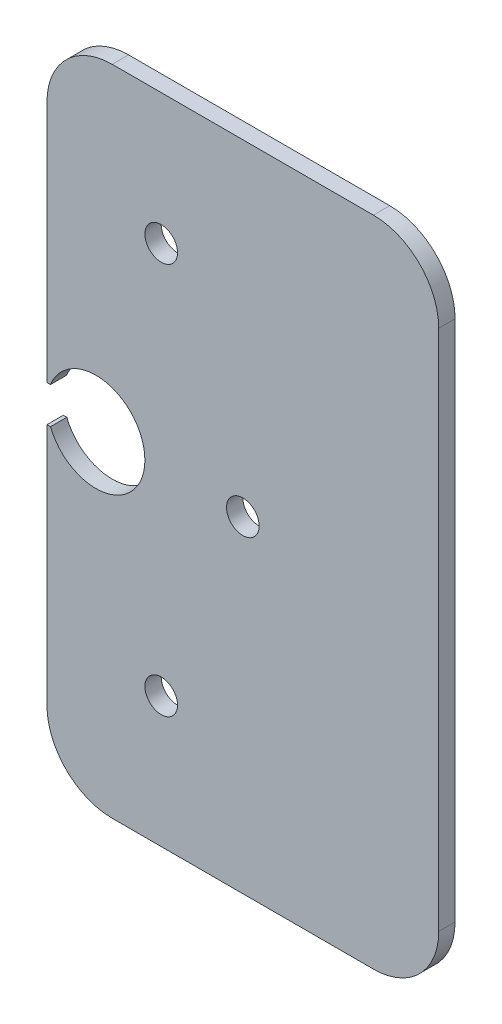
ISO-10303-21;
HEADER;
FILE_DESCRIPTION(('STEP AP214'),'2;1');
FILE_NAME('part.step','',(''),(''),'','','');
FILE_SCHEMA(('AUTOMOTIVE_DESIGN { 1 0 10303 214 1 1 1 1 }'));
ENDSEC;
DATA;
#1=APPLICATION_CONTEXT('core data for automotive mechanical design processes');
#2=APPLICATION_PROTOCOL_DEFINITION('international standard','automotive_design',2000,#1);
#3=PRODUCT_CONTEXT('',#1,'mechanical');
#4=PRODUCT('Part','Part','',(#3));
#5=PRODUCT_RELATED_PRODUCT_CATEGORY('part','',(#4));
#6=PRODUCT_DEFINITION_FORMATION('','',#4);
#7=PRODUCT_DEFINITION_CONTEXT('part definition',#1,'design');
#8=PRODUCT_DEFINITION('design','',#6,#7);
#9=PRODUCT_DEFINITION_SHAPE('','',#8);
#10=(LENGTH_UNIT() NAMED_UNIT(*) SI_UNIT(.MILLI.,.METRE.));
#11=(NAMED_UNIT(*) PLANE_ANGLE_UNIT() SI_UNIT($,.RADIAN.));
#12=(NAMED_UNIT(*) SI_UNIT($,.STERADIAN.) SOLID_ANGLE_UNIT());
#13=UNCERTAINTY_MEASURE_WITH_UNIT(LENGTH_MEASURE(1.E-05),#10,'distance_accuracy_value','');
#14=(GEOMETRIC_REPRESENTATION_CONTEXT(3) GLOBAL_UNCERTAINTY_ASSIGNED_CONTEXT((#13)) GLOBAL_UNIT_ASSIGNED_CONTEXT((#10,
#11,#12)) REPRESENTATION_CONTEXT('',''));
#15=CARTESIAN_POINT('',(0.,0.,0.));
#16=DIRECTION('',(0.,0.,1.));
#17=DIRECTION('',(1.,0.,0.));
#18=AXIS2_PLACEMENT_3D('',#15,#16,#17);
#19=CARTESIAN_POINT('',(-450.215,1024.45552803745,3.175));
#20=DIRECTION('',(0.,0.,1.));
#21=DIRECTION('',(0.,1.,0.));
#22=AXIS2_PLACEMENT_3D('',#19,#20,#21);
#23=ELLIPSE('',#22,9.54794789392333,9.52500000000006);
#24=DIRECTION('',(0.,0.,-1.));
#25=VECTOR('',#24,1.);
#26=SURFACE_OF_LINEAR_EXTRUSION('',#23,#25);
#27=CARTESIAN_POINT('',(-450.215,1024.45552803745,0.));
#28=DIRECTION('',(0.,0.,1.));
#29=DIRECTION('',(0.,1.,0.));
#30=AXIS2_PLACEMENT_3D('',#27,#28,#29);
#31=ELLIPSE('',#30,9.54794789392333,9.52500000000006);
#32=CARTESIAN_POINT('',(-459.058883104327,1020.90986665038,0.));
#33=VERTEX_POINT('',#32);
#34=CARTESIAN_POINT('',(-459.058883104327,1028.00118942453,0.));
#35=VERTEX_POINT('',#34);
#36=EDGE_CURVE('E164',#33,#35,#31,.T.);
#37=ORIENTED_EDGE('',*,*,#36,.F.);
#38=DIRECTION('',(0.,0.,-1.));
#39=VECTOR('',#38,1.);
#40=CARTESIAN_POINT('',(-459.058883104327,1020.90986665038,3.175));
#41=LINE('',#40,#39);
#42=CARTESIAN_POINT('',(-459.058883104327,1020.90986665038,3.175));
#43=VERTEX_POINT('',#42);
#44=EDGE_CURVE('E11',#43,#33,#41,.T.);
#45=ORIENTED_EDGE('',*,*,#44,.F.);
#46=CARTESIAN_POINT('',(-459.058883104327,1028.00118942453,3.175));
#47=VERTEX_POINT('',#46);
#48=EDGE_CURVE('E203',#43,#47,#23,.T.);
#49=ORIENTED_EDGE('',*,*,#48,.T.);
#50=DIRECTION('',(0.,0.,-1.));
#51=VECTOR('',#50,1.);
#52=CARTESIAN_POINT('',(-459.058883104327,1028.00118942453,3.175));
#53=LINE('',#52,#51);
#54=EDGE_CURVE('E99',#47,#35,#53,.T.);
#55=ORIENTED_EDGE('',*,*,#54,.T.);
#56=EDGE_LOOP('',(#37,#45,#49,#55));
#57=FACE_BOUND('',#56,.T.);
#58=ADVANCED_FACE('F36',(#57),#26,.T.);
#59=CARTESIAN_POINT('',(0.,1020.90986665038,3.175));
#60=DIRECTION('',(0.,1.,0.));
#61=DIRECTION('',(0.,0.,1.));
#62=AXIS2_PLACEMENT_3D('',#59,#60,#61);
#63=PLANE('',#62);
#64=DIRECTION('',(1.,0.,0.));
#65=VECTOR('',#64,1.);
#66=CARTESIAN_POINT('',(0.,1020.90986665038,0.));
#67=LINE('',#66,#65);
#68=CARTESIAN_POINT('',(-459.74,1020.90986665038,0.));
#69=VERTEX_POINT('',#68);
#70=EDGE_CURVE('E167',#69,#33,#67,.T.);
#71=ORIENTED_EDGE('',*,*,#70,.F.);
#72=DIRECTION('',(0.,0.,-1.));
#73=VECTOR('',#72,1.);
#74=CARTESIAN_POINT('',(-459.74,1020.90986665038,3.175));
#75=LINE('',#74,#73);
#76=CARTESIAN_POINT('',(-459.74,1020.90986665038,3.175));
#77=VERTEX_POINT('',#76);
#78=EDGE_CURVE('E45',#77,#69,#75,.T.);
#79=ORIENTED_EDGE('',*,*,#78,.F.);
#80=DIRECTION('',(1.,0.,0.));
#81=VECTOR('',#80,1.);
#82=CARTESIAN_POINT('',(0.,1020.90986665038,3.175));
#83=LINE('',#82,#81);
#84=EDGE_CURVE('E243',#77,#43,#83,.T.);
#85=ORIENTED_EDGE('',*,*,#84,.T.);
#86=ORIENTED_EDGE('',*,*,#44,.T.);
#87=EDGE_LOOP('',(#71,#79,#85,#86));
#88=FACE_BOUND('',#87,.T.);
#89=ADVANCED_FACE('F230',(#88),#63,.T.);
#90=CARTESIAN_POINT('',(-459.74,0.,3.175));
#91=DIRECTION('',(-1.,0.,0.));
#92=DIRECTION('',(0.,0.,1.));
#93=AXIS2_PLACEMENT_3D('',#90,#91,#92);
#94=PLANE('',#93);
#95=DIRECTION('',(0.,1.,0.));
#96=VECTOR('',#95,1.);
#97=CARTESIAN_POINT('',(-459.74,0.,0.));
#98=LINE('',#97,#96);
#99=CARTESIAN_POINT('',(-459.74,973.655528037452,0.));
#100=VERTEX_POINT('',#99);
#101=EDGE_CURVE('E170',#100,#69,#98,.T.);
#102=ORIENTED_EDGE('',*,*,#101,.F.);
#103=DIRECTION('',(0.,0.,-1.));
#104=VECTOR('',#103,1.);
#105=CARTESIAN_POINT('',(-459.74,973.655528037452,3.175));
#106=LINE('',#105,#104);
#107=CARTESIAN_POINT('',(-459.74,973.655528037452,3.175));
#108=VERTEX_POINT('',#107);
#109=EDGE_CURVE('E219',#108,#100,#106,.T.);
#110=ORIENTED_EDGE('',*,*,#109,.F.);
#111=DIRECTION('',(0.,1.,0.));
#112=VECTOR('',#111,1.);
#113=CARTESIAN_POINT('',(-459.74,0.,3.175));
#114=LINE('',#113,#112);
#115=EDGE_CURVE('E226',#108,#77,#114,.T.);
#116=ORIENTED_EDGE('',*,*,#115,.T.);
#117=ORIENTED_EDGE('',*,*,#78,.T.);
#118=EDGE_LOOP('',(#102,#110,#116,#117));
#119=FACE_BOUND('',#118,.T.);
#120=ADVANCED_FACE('F224',(#119),#94,.T.);
#121=CARTESIAN_POINT('',(-447.04,973.655528037452,3.175));
#122=DIRECTION('',(0.,0.,-1.));
#123=DIRECTION('',(-1.,0.,0.));
#124=AXIS2_PLACEMENT_3D('',#121,#122,#123);
#125=CYLINDRICAL_SURFACE('',#124,12.7);
#126=CARTESIAN_POINT('',(-447.04,973.655528037452,0.));
#127=DIRECTION('',(0.,0.,1.));
#128=DIRECTION('',(1.,0.,0.));
#129=AXIS2_PLACEMENT_3D('',#126,#127,#128);
#130=CIRCLE('',#129,12.7);
#131=CARTESIAN_POINT('',(-447.04,960.955528037452,0.));
#132=VERTEX_POINT('',#131);
#133=EDGE_CURVE('E173',#132,#100,#130,.F.);
#134=ORIENTED_EDGE('',*,*,#133,.F.);
#135=DIRECTION('',(0.,0.,-1.));
#136=VECTOR('',#135,1.);
#137=CARTESIAN_POINT('',(-447.04,960.955528037452,3.175));
#138=LINE('',#137,#136);
#139=CARTESIAN_POINT('',(-447.04,960.955528037452,3.175));
#140=VERTEX_POINT('',#139);
#141=EDGE_CURVE('E217',#140,#132,#138,.T.);
#142=ORIENTED_EDGE('',*,*,#141,.F.);
#143=CARTESIAN_POINT('',(-447.04,973.655528037452,3.175));
#144=DIRECTION('',(0.,0.,1.));
#145=DIRECTION('',(1.,0.,0.));
#146=AXIS2_PLACEMENT_3D('',#143,#144,#145);
#147=CIRCLE('',#146,12.7);
#148=EDGE_CURVE('E242',#140,#108,#147,.F.);
#149=ORIENTED_EDGE('',*,*,#148,.T.);
#150=ORIENTED_EDGE('',*,*,#109,.T.);
#151=EDGE_LOOP('',(#134,#142,#149,#150));
#152=FACE_BOUND('',#151,.T.);
#153=ADVANCED_FACE('F238',(#152),#125,.T.);
#154=CARTESIAN_POINT('',(2.10014754501576E-12,960.955528037451,3.175));
#155=DIRECTION('',(0.,1.,0.));
#156=DIRECTION('',(-1.,0.,0.));
#157=AXIS2_PLACEMENT_3D('',#154,#155,#156);
#158=PLANE('',#157);
#159=DIRECTION('',(1.,0.,0.));
#160=VECTOR('',#159,1.);
#161=CARTESIAN_POINT('',(2.10014754501576E-12,960.955528037451,0.));
#162=LINE('',#161,#160);
#163=CARTESIAN_POINT('',(-396.24,960.955528037452,0.));
#164=VERTEX_POINT('',#163);
#165=EDGE_CURVE('E176',#132,#164,#162,.T.);
#166=ORIENTED_EDGE('',*,*,#165,.T.);
#167=DIRECTION('',(0.,0.,-1.));
#168=VECTOR('',#167,1.);
#169=CARTESIAN_POINT('',(-396.24,960.955528037452,3.175));
#170=LINE('',#169,#168);
#171=CARTESIAN_POINT('',(-396.24,960.955528037452,3.175));
#172=VERTEX_POINT('',#171);
#173=EDGE_CURVE('E214',#172,#164,#170,.T.);
#174=ORIENTED_EDGE('',*,*,#173,.F.);
#175=DIRECTION('',(1.,0.,0.));
#176=VECTOR('',#175,1.);
#177=CARTESIAN_POINT('',(2.10014754501576E-12,960.955528037451,3.175));
#178=LINE('',#177,#176);
#179=EDGE_CURVE('E245',#140,#172,#178,.T.);
#180=ORIENTED_EDGE('',*,*,#179,.F.);
#181=ORIENTED_EDGE('',*,*,#141,.T.);
#182=EDGE_LOOP('',(#166,#174,#180,#181));
#183=FACE_BOUND('',#182,.T.);
#184=ADVANCED_FACE('F273',(#183),#158,.F.);
#185=CARTESIAN_POINT('',(-396.24,973.655528037452,3.175));
#186=DIRECTION('',(0.,0.,-1.));
#187=DIRECTION('',(-1.,0.,0.));
#188=AXIS2_PLACEMENT_3D('',#185,#186,#187);
#189=CYLINDRICAL_SURFACE('',#188,12.7);
#190=CARTESIAN_POINT('',(-396.24,973.655528037452,0.));
#191=DIRECTION('',(0.,0.,1.));
#192=DIRECTION('',(1.,0.,0.));
#193=AXIS2_PLACEMENT_3D('',#190,#191,#192);
#194=CIRCLE('',#193,12.7);
#195=CARTESIAN_POINT('',(-383.54,973.655528037452,0.));
#196=VERTEX_POINT('',#195);
#197=EDGE_CURVE('E178',#164,#196,#194,.T.);
#198=ORIENTED_EDGE('',*,*,#197,.T.);
#199=DIRECTION('',(0.,0.,-1.));
#200=VECTOR('',#199,1.);
#201=CARTESIAN_POINT('',(-383.54,973.655528037452,3.175));
#202=LINE('',#201,#200);
#203=CARTESIAN_POINT('',(-383.54,973.655528037452,3.175));
#204=VERTEX_POINT('',#203);
#205=EDGE_CURVE('E211',#204,#196,#202,.T.);
#206=ORIENTED_EDGE('',*,*,#205,.F.);
#207=CARTESIAN_POINT('',(-396.24,973.655528037452,3.175));
#208=DIRECTION('',(0.,0.,1.));
#209=DIRECTION('',(1.,0.,0.));
#210=AXIS2_PLACEMENT_3D('',#207,#208,#209);
#211=CIRCLE('',#210,12.7);
#212=EDGE_CURVE('E250',#172,#204,#211,.T.);
#213=ORIENTED_EDGE('',*,*,#212,.F.);
#214=ORIENTED_EDGE('',*,*,#173,.T.);
#215=EDGE_LOOP('',(#198,#206,#213,#214));
#216=FACE_BOUND('',#215,.T.);
#217=ADVANCED_FACE('F276',(#216),#189,.T.);
#218=CARTESIAN_POINT('',(-383.54,0.,3.175));
#219=DIRECTION('',(-1.,0.,0.));
#220=DIRECTION('',(0.,0.,1.));
#221=AXIS2_PLACEMENT_3D('',#218,#219,#220);
#222=PLANE('',#221);
#223=DIRECTION('',(0.,1.,0.));
#224=VECTOR('',#223,1.);
#225=CARTESIAN_POINT('',(-383.54,0.,0.));
#226=LINE('',#225,#224);
#227=CARTESIAN_POINT('',(-383.54,1075.25552803745,0.));
#228=VERTEX_POINT('',#227);
#229=EDGE_CURVE('E180',#196,#228,#226,.T.);
#230=ORIENTED_EDGE('',*,*,#229,.T.);
#231=DIRECTION('',(0.,0.,-1.));
#232=VECTOR('',#231,1.);
#233=CARTESIAN_POINT('',(-383.54,1075.25552803745,3.175));
#234=LINE('',#233,#232);
#235=CARTESIAN_POINT('',(-383.54,1075.25552803745,3.175));
#236=VERTEX_POINT('',#235);
#237=EDGE_CURVE('E209',#236,#228,#234,.T.);
#238=ORIENTED_EDGE('',*,*,#237,.F.);
#239=DIRECTION('',(0.,1.,0.));
#240=VECTOR('',#239,1.);
#241=CARTESIAN_POINT('',(-383.54,0.,3.175));
#242=LINE('',#241,#240);
#243=EDGE_CURVE('E252',#204,#236,#242,.T.);
#244=ORIENTED_EDGE('',*,*,#243,.F.);
#245=ORIENTED_EDGE('',*,*,#205,.T.);
#246=EDGE_LOOP('',(#230,#238,#244,#245));
#247=FACE_BOUND('',#246,.T.);
#248=ADVANCED_FACE('F280',(#247),#222,.F.);
#249=CARTESIAN_POINT('',(-396.24,1075.25552803745,3.175));
#250=DIRECTION('',(0.,0.,-1.));
#251=DIRECTION('',(-1.,0.,0.));
#252=AXIS2_PLACEMENT_3D('',#249,#250,#251);
#253=CYLINDRICAL_SURFACE('',#252,12.7);
#254=CARTESIAN_POINT('',(-396.24,1075.25552803745,0.));
#255=DIRECTION('',(0.,0.,1.));
#256=DIRECTION('',(1.,0.,0.));
#257=AXIS2_PLACEMENT_3D('',#254,#255,#256);
#258=CIRCLE('',#257,12.7);
#259=CARTESIAN_POINT('',(-396.24,1087.95552803745,0.));
#260=VERTEX_POINT('',#259);
#261=EDGE_CURVE('E183',#260,#228,#258,.F.);
#262=ORIENTED_EDGE('',*,*,#261,.F.);
#263=DIRECTION('',(0.,0.,-1.));
#264=VECTOR('',#263,1.);
#265=CARTESIAN_POINT('',(-396.24,1087.95552803745,3.175));
#266=LINE('',#265,#264);
#267=CARTESIAN_POINT('',(-396.24,1087.95552803745,3.175));
#268=VERTEX_POINT('',#267);
#269=EDGE_CURVE('E207',#268,#260,#266,.T.);
#270=ORIENTED_EDGE('',*,*,#269,.F.);
#271=CARTESIAN_POINT('',(-396.24,1075.25552803745,3.175));
#272=DIRECTION('',(0.,0.,1.));
#273=DIRECTION('',(1.,0.,0.));
#274=AXIS2_PLACEMENT_3D('',#271,#272,#273);
#275=CIRCLE('',#274,12.7);
#276=EDGE_CURVE('E254',#268,#236,#275,.F.);
#277=ORIENTED_EDGE('',*,*,#276,.T.);
#278=ORIENTED_EDGE('',*,*,#237,.T.);
#279=EDGE_LOOP('',(#262,#270,#277,#278));
#280=FACE_BOUND('',#279,.T.);
#281=ADVANCED_FACE('F284',(#280),#253,.T.);
#282=CARTESIAN_POINT('',(0.,1087.95552803745,3.175));
#283=DIRECTION('',(0.,1.,0.));
#284=DIRECTION('',(0.,0.,1.));
#285=AXIS2_PLACEMENT_3D('',#282,#283,#284);
#286=PLANE('',#285);
#287=DIRECTION('',(1.,0.,0.));
#288=VECTOR('',#287,1.);
#289=CARTESIAN_POINT('',(0.,1087.95552803745,0.));
#290=LINE('',#289,#288);
#291=CARTESIAN_POINT('',(-447.04,1087.95552803745,0.));
#292=VERTEX_POINT('',#291);
#293=EDGE_CURVE('E186',#292,#260,#290,.T.);
#294=ORIENTED_EDGE('',*,*,#293,.F.);
#295=DIRECTION('',(0.,0.,-1.));
#296=VECTOR('',#295,1.);
#297=CARTESIAN_POINT('',(-447.04,1087.95552803745,3.175));
#298=LINE('',#297,#296);
#299=CARTESIAN_POINT('',(-447.04,1087.95552803745,3.175));
#300=VERTEX_POINT('',#299);
#301=EDGE_CURVE('E140',#300,#292,#298,.T.);
#302=ORIENTED_EDGE('',*,*,#301,.F.);
#303=DIRECTION('',(1.,0.,0.));
#304=VECTOR('',#303,1.);
#305=CARTESIAN_POINT('',(0.,1087.95552803745,3.175));
#306=LINE('',#305,#304);
#307=EDGE_CURVE('E148',#300,#268,#306,.T.);
#308=ORIENTED_EDGE('',*,*,#307,.T.);
#309=ORIENTED_EDGE('',*,*,#269,.T.);
#310=EDGE_LOOP('',(#294,#302,#308,#309));
#311=FACE_BOUND('',#310,.T.);
#312=ADVANCED_FACE('F258',(#311),#286,.T.);
#313=CARTESIAN_POINT('',(-447.04,1075.25552803745,3.175));
#314=DIRECTION('',(0.,0.,-1.));
#315=DIRECTION('',(-1.,0.,0.));
#316=AXIS2_PLACEMENT_3D('',#313,#314,#315);
#317=CYLINDRICAL_SURFACE('',#316,12.7);
#318=CARTESIAN_POINT('',(-447.04,1075.25552803745,0.));
#319=DIRECTION('',(0.,0.,1.));
#320=DIRECTION('',(1.,0.,0.));
#321=AXIS2_PLACEMENT_3D('',#318,#319,#320);
#322=CIRCLE('',#321,12.7);
#323=CARTESIAN_POINT('',(-459.74,1075.25552803745,0.));
#324=VERTEX_POINT('',#323);
#325=EDGE_CURVE('E135',#324,#292,#322,.F.);
#326=ORIENTED_EDGE('',*,*,#325,.F.);
#327=DIRECTION('',(0.,0.,-1.));
#328=VECTOR('',#327,1.);
#329=CARTESIAN_POINT('',(-459.74,1075.25552803745,3.175));
#330=LINE('',#329,#328);
#331=CARTESIAN_POINT('',(-459.74,1075.25552803745,3.175));
#332=VERTEX_POINT('',#331);
#333=EDGE_CURVE('E130',#332,#324,#330,.T.);
#334=ORIENTED_EDGE('',*,*,#333,.F.);
#335=CARTESIAN_POINT('',(-447.04,1075.25552803745,3.175));
#336=DIRECTION('',(0.,0.,1.));
#337=DIRECTION('',(1.,0.,0.));
#338=AXIS2_PLACEMENT_3D('',#335,#336,#337);
#339=CIRCLE('',#338,12.7);
#340=EDGE_CURVE('E133',#332,#300,#339,.F.);
#341=ORIENTED_EDGE('',*,*,#340,.T.);
#342=ORIENTED_EDGE('',*,*,#301,.T.);
#343=EDGE_LOOP('',(#326,#334,#341,#342));
#344=FACE_BOUND('',#343,.T.);
#345=ADVANCED_FACE('F132',(#344),#317,.T.);
#346=CARTESIAN_POINT('',(-459.74,0.,3.175));
#347=DIRECTION('',(-1.,0.,0.));
#348=DIRECTION('',(0.,0.,1.));
#349=AXIS2_PLACEMENT_3D('',#346,#347,#348);
#350=PLANE('',#349);
#351=DIRECTION('',(0.,1.,0.));
#352=VECTOR('',#351,1.);
#353=CARTESIAN_POINT('',(-459.74,0.,0.));
#354=LINE('',#353,#352);
#355=CARTESIAN_POINT('',(-459.74,1028.00118942453,0.));
#356=VERTEX_POINT('',#355);
#357=EDGE_CURVE('E190',#356,#324,#354,.T.);
#358=ORIENTED_EDGE('',*,*,#357,.F.);
#359=DIRECTION('',(0.,0.,-1.));
#360=VECTOR('',#359,1.);
#361=CARTESIAN_POINT('',(-459.74,1028.00118942453,3.175));
#362=LINE('',#361,#360);
#363=CARTESIAN_POINT('',(-459.74,1028.00118942453,3.175));
#364=VERTEX_POINT('',#363);
#365=EDGE_CURVE('E92',#364,#356,#362,.T.);
#366=ORIENTED_EDGE('',*,*,#365,.F.);
#367=DIRECTION('',(0.,1.,0.));
#368=VECTOR('',#367,1.);
#369=CARTESIAN_POINT('',(-459.74,0.,3.175));
#370=LINE('',#369,#368);
#371=EDGE_CURVE('E145',#364,#332,#370,.T.);
#372=ORIENTED_EDGE('',*,*,#371,.T.);
#373=ORIENTED_EDGE('',*,*,#333,.T.);
#374=EDGE_LOOP('',(#358,#366,#372,#373));
#375=FACE_BOUND('',#374,.T.);
#376=ADVANCED_FACE('F150',(#375),#350,.T.);
#377=CARTESIAN_POINT('',(-437.515,986.355528037452,3.175));
#378=DIRECTION('',(0.,0.,-1.));
#379=DIRECTION('',(-1.,0.,0.));
#380=AXIS2_PLACEMENT_3D('',#377,#378,#379);
#381=CYLINDRICAL_SURFACE('',#380,3.17499999999981);
#382=CARTESIAN_POINT('',(-437.515,986.355528037452,3.175));
#383=DIRECTION('',(0.,0.,1.));
#384=DIRECTION('',(1.,0.,0.));
#385=AXIS2_PLACEMENT_3D('',#382,#383,#384);
#386=CIRCLE('',#385,3.17499999999981);
#387=CARTESIAN_POINT('',(-434.34,986.355528037452,3.175));
#388=VERTEX_POINT('',#387);
#389=EDGE_CURVE('E158',#388,#388,#386,.T.);
#390=ORIENTED_EDGE('',*,*,#389,.T.);
#391=EDGE_LOOP('',(#390));
#392=FACE_BOUND('',#391,.T.);
#393=CARTESIAN_POINT('',(-437.515,986.355528037452,0.));
#394=DIRECTION('',(0.,0.,1.));
#395=DIRECTION('',(1.,0.,0.));
#396=AXIS2_PLACEMENT_3D('',#393,#394,#395);
#397=CIRCLE('',#396,3.17499999999981);
#398=CARTESIAN_POINT('',(-434.34,986.355528037452,0.));
#399=VERTEX_POINT('',#398);
#400=EDGE_CURVE('E197',#399,#399,#397,.T.);
#401=ORIENTED_EDGE('',*,*,#400,.F.);
#402=EDGE_LOOP('',(#401));
#403=FACE_BOUND('',#402,.T.);
#404=ADVANCED_FACE('F295',(#392,#403),#381,.F.);
#405=CARTESIAN_POINT('',(-421.64,1024.45552803745,3.175));
#406=DIRECTION('',(0.,0.,-1.));
#407=DIRECTION('',(-1.,0.,0.));
#408=AXIS2_PLACEMENT_3D('',#405,#406,#407);
#409=CYLINDRICAL_SURFACE('',#408,3.17499999999967);
#410=CARTESIAN_POINT('',(-421.64,1024.45552803745,3.175));
#411=DIRECTION('',(0.,0.,1.));
#412=DIRECTION('',(1.,0.,0.));
#413=AXIS2_PLACEMENT_3D('',#410,#411,#412);
#414=CIRCLE('',#413,3.17499999999967);
#415=CARTESIAN_POINT('',(-418.465,1024.45552803745,3.175));
#416=VERTEX_POINT('',#415);
#417=EDGE_CURVE('E152',#416,#416,#414,.T.);
#418=ORIENTED_EDGE('',*,*,#417,.T.);
#419=EDGE_LOOP('',(#418));
#420=FACE_BOUND('',#419,.T.);
#421=CARTESIAN_POINT('',(-421.64,1024.45552803745,0.));
#422=DIRECTION('',(0.,0.,1.));
#423=DIRECTION('',(1.,0.,0.));
#424=AXIS2_PLACEMENT_3D('',#421,#422,#423);
#425=CIRCLE('',#424,3.17499999999967);
#426=CARTESIAN_POINT('',(-418.465,1024.45552803745,0.));
#427=VERTEX_POINT('',#426);
#428=EDGE_CURVE('E194',#427,#427,#425,.T.);
#429=ORIENTED_EDGE('',*,*,#428,.F.);
#430=EDGE_LOOP('',(#429));
#431=FACE_BOUND('',#430,.T.);
#432=ADVANCED_FACE('F299',(#420,#431),#409,.F.);
#433=CARTESIAN_POINT('',(0.,1028.00118942453,3.175));
#434=DIRECTION('',(0.,1.,0.));
#435=DIRECTION('',(0.,0.,1.));
#436=AXIS2_PLACEMENT_3D('',#433,#434,#435);
#437=PLANE('',#436);
#438=DIRECTION('',(1.,0.,0.));
#439=VECTOR('',#438,1.);
#440=CARTESIAN_POINT('',(0.,1028.00118942453,0.));
#441=LINE('',#440,#439);
#442=EDGE_CURVE('E192',#356,#35,#441,.T.);
#443=ORIENTED_EDGE('',*,*,#442,.T.);
#444=ORIENTED_EDGE('',*,*,#54,.F.);
#445=DIRECTION('',(1.,0.,0.));
#446=VECTOR('',#445,1.);
#447=CARTESIAN_POINT('',(0.,1028.00118942453,3.175));
#448=LINE('',#447,#446);
#449=EDGE_CURVE('E53',#364,#47,#448,.T.);
#450=ORIENTED_EDGE('',*,*,#449,.F.);
#451=ORIENTED_EDGE('',*,*,#365,.T.);
#452=EDGE_LOOP('',(#443,#444,#450,#451));
#453=FACE_BOUND('',#452,.T.);
#454=ADVANCED_FACE('F260',(#453),#437,.F.);
#455=CARTESIAN_POINT('',(-437.515,1062.55552803745,3.175));
#456=DIRECTION('',(0.,0.,-1.));
#457=DIRECTION('',(-1.,0.,0.));
#458=AXIS2_PLACEMENT_3D('',#455,#456,#457);
#459=CYLINDRICAL_SURFACE('',#458,3.17499999999967);
#460=CARTESIAN_POINT('',(-437.515,1062.55552803745,3.175));
#461=DIRECTION('',(0.,0.,1.));
#462=DIRECTION('',(1.,0.,0.));
#463=AXIS2_PLACEMENT_3D('',#460,#461,#462);
#464=CIRCLE('',#463,3.17499999999967);
#465=CARTESIAN_POINT('',(-434.34,1062.55552803745,3.175));
#466=VERTEX_POINT('',#465);
#467=EDGE_CURVE('E161',#466,#466,#464,.T.);
#468=ORIENTED_EDGE('',*,*,#467,.T.);
#469=EDGE_LOOP('',(#468));
#470=FACE_BOUND('',#469,.T.);
#471=CARTESIAN_POINT('',(-437.515,1062.55552803745,0.));
#472=DIRECTION('',(0.,0.,1.));
#473=DIRECTION('',(1.,0.,0.));
#474=AXIS2_PLACEMENT_3D('',#471,#472,#473);
#475=CIRCLE('',#474,3.17499999999967);
#476=CARTESIAN_POINT('',(-434.34,1062.55552803745,0.));
#477=VERTEX_POINT('',#476);
#478=EDGE_CURVE('E200',#477,#477,#475,.T.);
#479=ORIENTED_EDGE('',*,*,#478,.F.);
#480=EDGE_LOOP('',(#479));
#481=FACE_BOUND('',#480,.T.);
#482=ADVANCED_FACE('F298',(#470,#481),#459,.F.);
#483=CARTESIAN_POINT('',(0.,0.,3.175));
#484=DIRECTION('',(0.,0.,1.));
#485=DIRECTION('',(1.,0.,0.));
#486=AXIS2_PLACEMENT_3D('',#483,#484,#485);
#487=PLANE('',#486);
#488=ORIENTED_EDGE('',*,*,#48,.F.);
#489=ORIENTED_EDGE('',*,*,#84,.F.);
#490=ORIENTED_EDGE('',*,*,#115,.F.);
#491=ORIENTED_EDGE('',*,*,#148,.F.);
#492=ORIENTED_EDGE('',*,*,#179,.T.);
#493=ORIENTED_EDGE('',*,*,#212,.T.);
#494=ORIENTED_EDGE('',*,*,#243,.T.);
#495=ORIENTED_EDGE('',*,*,#276,.F.);
#496=ORIENTED_EDGE('',*,*,#307,.F.);
#497=ORIENTED_EDGE('',*,*,#340,.F.);
#498=ORIENTED_EDGE('',*,*,#371,.F.);
#499=ORIENTED_EDGE('',*,*,#449,.T.);
#500=EDGE_LOOP('',(#488,#489,#490,#491,#492,#493,#494,#495,#496,#497,#498,#499));
#501=FACE_BOUND('',#500,.T.);
#502=ORIENTED_EDGE('',*,*,#417,.F.);
#503=EDGE_LOOP('',(#502));
#504=FACE_BOUND('',#503,.T.);
#505=ORIENTED_EDGE('',*,*,#389,.F.);
#506=EDGE_LOOP('',(#505));
#507=FACE_BOUND('',#506,.T.);
#508=ORIENTED_EDGE('',*,*,#467,.F.);
#509=EDGE_LOOP('',(#508));
#510=FACE_BOUND('',#509,.T.);
#511=ADVANCED_FACE('F143',(#501,#504,#507,#510),#487,.T.);
#512=CARTESIAN_POINT('',(0.,0.,0.));
#513=DIRECTION('',(0.,0.,1.));
#514=DIRECTION('',(1.,0.,0.));
#515=AXIS2_PLACEMENT_3D('',#512,#513,#514);
#516=PLANE('',#515);
#517=ORIENTED_EDGE('',*,*,#36,.T.);
#518=ORIENTED_EDGE('',*,*,#442,.F.);
#519=ORIENTED_EDGE('',*,*,#357,.T.);
#520=ORIENTED_EDGE('',*,*,#325,.T.);
#521=ORIENTED_EDGE('',*,*,#293,.T.);
#522=ORIENTED_EDGE('',*,*,#261,.T.);
#523=ORIENTED_EDGE('',*,*,#229,.F.);
#524=ORIENTED_EDGE('',*,*,#197,.F.);
#525=ORIENTED_EDGE('',*,*,#165,.F.);
#526=ORIENTED_EDGE('',*,*,#133,.T.);
#527=ORIENTED_EDGE('',*,*,#101,.T.);
#528=ORIENTED_EDGE('',*,*,#70,.T.);
#529=EDGE_LOOP('',(#517,#518,#519,#520,#521,#522,#523,#524,#525,#526,#527,#528));
#530=FACE_BOUND('',#529,.T.);
#531=ORIENTED_EDGE('',*,*,#428,.T.);
#532=EDGE_LOOP('',(#531));
#533=FACE_BOUND('',#532,.T.);
#534=ORIENTED_EDGE('',*,*,#400,.T.);
#535=EDGE_LOOP('',(#534));
#536=FACE_BOUND('',#535,.T.);
#537=ORIENTED_EDGE('',*,*,#478,.T.);
#538=EDGE_LOOP('',(#537));
#539=FACE_BOUND('',#538,.T.);
#540=ADVANCED_FACE('F232',(#530,#533,#536,#539),#516,.F.);
#541=CLOSED_SHELL('',(#58,#89,#120,#153,#184,#217,#248,#281,#312,#345,#376,#404,#432,#454,#482,
#511,#540));
#542=MANIFOLD_SOLID_BREP('B2',#541);
#543=ADVANCED_BREP_SHAPE_REPRESENTATION('',(#18,#542),#14);
#544=SHAPE_DEFINITION_REPRESENTATION(#9,#543);
ENDSEC;
END-ISO-10303-21;
